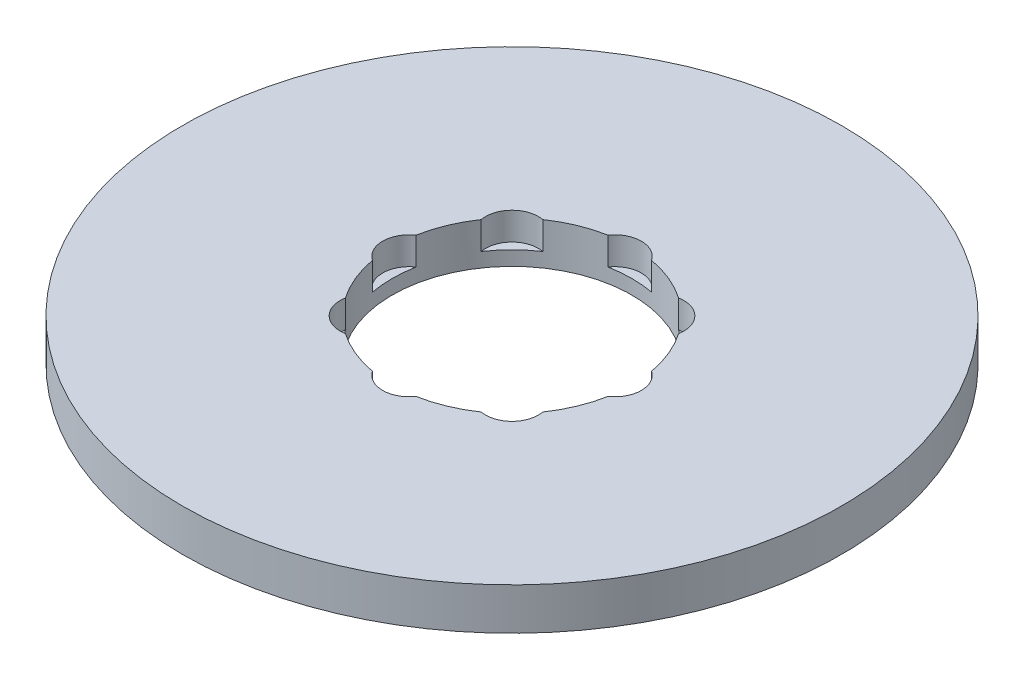
ISO-10303-21;
HEADER;
FILE_DESCRIPTION(('STEP AP214'),'2;1');
FILE_NAME('part.step','',(''),(''),'','','');
FILE_SCHEMA(('AUTOMOTIVE_DESIGN { 1 0 10303 214 1 1 1 1 }'));
ENDSEC;
DATA;
#1=APPLICATION_CONTEXT('core data for automotive mechanical design processes');
#2=APPLICATION_PROTOCOL_DEFINITION('international standard','automotive_design',2000,#1);
#3=PRODUCT_CONTEXT('',#1,'mechanical');
#4=PRODUCT('Part','Part','',(#3));
#5=PRODUCT_RELATED_PRODUCT_CATEGORY('part','',(#4));
#6=PRODUCT_DEFINITION_FORMATION('','',#4);
#7=PRODUCT_DEFINITION_CONTEXT('part definition',#1,'design');
#8=PRODUCT_DEFINITION('design','',#6,#7);
#9=PRODUCT_DEFINITION_SHAPE('','',#8);
#10=(LENGTH_UNIT() NAMED_UNIT(*) SI_UNIT(.MILLI.,.METRE.));
#11=(NAMED_UNIT(*) PLANE_ANGLE_UNIT() SI_UNIT($,.RADIAN.));
#12=(NAMED_UNIT(*) SI_UNIT($,.STERADIAN.) SOLID_ANGLE_UNIT());
#13=UNCERTAINTY_MEASURE_WITH_UNIT(LENGTH_MEASURE(1.E-05),#10,'distance_accuracy_value','');
#14=(GEOMETRIC_REPRESENTATION_CONTEXT(3) GLOBAL_UNCERTAINTY_ASSIGNED_CONTEXT((#13)) GLOBAL_UNIT_ASSIGNED_CONTEXT((#10,
#11,#12)) REPRESENTATION_CONTEXT('',''));
#15=CARTESIAN_POINT('',(0.,0.,0.));
#16=DIRECTION('',(0.,0.,1.));
#17=DIRECTION('',(1.,0.,0.));
#18=AXIS2_PLACEMENT_3D('',#15,#16,#17);
#19=CARTESIAN_POINT('',(0.,7.,0.));
#20=DIRECTION('',(0.,-1.,0.));
#21=DIRECTION('',(0.,0.,-1.));
#22=AXIS2_PLACEMENT_3D('',#19,#20,#21);
#23=CYLINDRICAL_SURFACE('',#22,55.);
#24=CARTESIAN_POINT('',(0.,7.,0.));
#25=DIRECTION('',(0.,1.,0.));
#26=DIRECTION('',(0.,0.,1.));
#27=AXIS2_PLACEMENT_3D('',#24,#25,#26);
#28=CIRCLE('',#27,55.);
#29=CARTESIAN_POINT('',(0.,7.,55.));
#30=VERTEX_POINT('',#29);
#31=EDGE_CURVE('E183',#30,#30,#28,.T.);
#32=ORIENTED_EDGE('',*,*,#31,.F.);
#33=EDGE_LOOP('',(#32));
#34=FACE_BOUND('',#33,.T.);
#35=CARTESIAN_POINT('',(0.,0.,0.));
#36=DIRECTION('',(0.,1.,0.));
#37=DIRECTION('',(0.,0.,1.));
#38=AXIS2_PLACEMENT_3D('',#35,#36,#37);
#39=CIRCLE('',#38,55.);
#40=CARTESIAN_POINT('',(0.,0.,55.));
#41=VERTEX_POINT('',#40);
#42=EDGE_CURVE('E182',#41,#41,#39,.T.);
#43=ORIENTED_EDGE('',*,*,#42,.T.);
#44=EDGE_LOOP('',(#43));
#45=FACE_BOUND('',#44,.T.);
#46=ADVANCED_FACE('F39',(#34,#45),#23,.T.);
#47=CARTESIAN_POINT('',(0.,7.,0.));
#48=DIRECTION('',(0.,1.,0.));
#49=DIRECTION('',(0.,0.,1.));
#50=AXIS2_PLACEMENT_3D('',#47,#48,#49);
#51=PLANE('',#50);
#52=CARTESIAN_POINT('',(0.,7.,17.1753294967243));
#53=DIRECTION('',(0.,1.,0.));
#54=DIRECTION('',(1.,0.,0.));
#55=AXIS2_PLACEMENT_3D('',#52,#53,#54);
#56=CIRCLE('',#55,4.40705011362245);
#57=CARTESIAN_POINT('',(-3.63515199168003,7.,19.6668673152941));
#58=VERTEX_POINT('',#57);
#59=CARTESIAN_POINT('',(3.63515199168017,7.,19.6668673152941));
#60=VERTEX_POINT('',#59);
#61=EDGE_CURVE('E256',#58,#60,#56,.T.);
#62=ORIENTED_EDGE('',*,*,#61,.F.);
#63=CARTESIAN_POINT('',(0.,7.,0.));
#64=DIRECTION('',(0.,1.,0.));
#65=DIRECTION('',(0.,0.,1.));
#66=AXIS2_PLACEMENT_3D('',#63,#64,#65);
#67=CIRCLE('',#66,20.);
#68=CARTESIAN_POINT('',(-11.3361346193797,7.,16.4770158673014));
#69=VERTEX_POINT('',#68);
#70=EDGE_CURVE('E175',#69,#58,#67,.T.);
#71=ORIENTED_EDGE('',*,*,#70,.F.);
#72=CARTESIAN_POINT('',(-12.144791956247,7.,12.1447919562471));
#73=DIRECTION('',(0.,1.,0.));
#74=DIRECTION('',(0.707106781186549,0.,0.707106781186546));
#75=AXIS2_PLACEMENT_3D('',#72,#73,#74);
#76=CIRCLE('',#75,4.40705011362245);
#77=CARTESIAN_POINT('',(-16.4770158673013,7.,11.3361346193798));
#78=VERTEX_POINT('',#77);
#79=EDGE_CURVE('E152',#78,#69,#76,.T.);
#80=ORIENTED_EDGE('',*,*,#79,.F.);
#81=CARTESIAN_POINT('',(-19.6668673152941,7.,3.6351519916801));
#82=VERTEX_POINT('',#81);
#83=EDGE_CURVE('E168',#82,#78,#67,.T.);
#84=ORIENTED_EDGE('',*,*,#83,.F.);
#85=CARTESIAN_POINT('',(-17.1753294967243,7.,0.));
#86=DIRECTION('',(0.,1.,0.));
#87=DIRECTION('',(0.,0.,1.));
#88=AXIS2_PLACEMENT_3D('',#85,#86,#87);
#89=CIRCLE('',#88,4.40705011362245);
#90=CARTESIAN_POINT('',(-19.6668673152941,7.,-3.6351519916801));
#91=VERTEX_POINT('',#90);
#92=EDGE_CURVE('E205',#91,#82,#89,.T.);
#93=ORIENTED_EDGE('',*,*,#92,.F.);
#94=CARTESIAN_POINT('',(-16.4770158673015,7.,-11.3361346193796));
#95=VERTEX_POINT('',#94);
#96=EDGE_CURVE('E181',#95,#91,#67,.T.);
#97=ORIENTED_EDGE('',*,*,#96,.F.);
#98=CARTESIAN_POINT('',(-12.1447919562472,7.,-12.1447919562469));
#99=DIRECTION('',(0.,1.,0.));
#100=DIRECTION('',(-0.707106781186539,0.,0.707106781186556));
#101=AXIS2_PLACEMENT_3D('',#98,#99,#100);
#102=CIRCLE('',#101,4.40705011362245);
#103=CARTESIAN_POINT('',(-11.33613461938,7.,-16.4770158673012));
#104=VERTEX_POINT('',#103);
#105=EDGE_CURVE('E453',#104,#95,#102,.T.);
#106=ORIENTED_EDGE('',*,*,#105,.F.);
#107=CARTESIAN_POINT('',(-3.63515199168031,7.,-19.6668673152941));
#108=VERTEX_POINT('',#107);
#109=EDGE_CURVE('E189',#108,#104,#67,.T.);
#110=ORIENTED_EDGE('',*,*,#109,.F.);
#111=CARTESIAN_POINT('',(-1.79902027278884E-13,7.,-17.1753294967243));
#112=DIRECTION('',(0.,1.,0.));
#113=DIRECTION('',(-1.,0.,0.));
#114=AXIS2_PLACEMENT_3D('',#111,#112,#113);
#115=CIRCLE('',#114,4.40705011362245);
#116=CARTESIAN_POINT('',(3.6351519916799,7.,-19.6668673152942));
#117=VERTEX_POINT('',#116);
#118=EDGE_CURVE('E462',#117,#108,#115,.T.);
#119=ORIENTED_EDGE('',*,*,#118,.F.);
#120=CARTESIAN_POINT('',(11.3361346193796,7.,-16.4770158673014));
#121=VERTEX_POINT('',#120);
#122=EDGE_CURVE('E197',#121,#117,#67,.T.);
#123=ORIENTED_EDGE('',*,*,#122,.F.);
#124=CARTESIAN_POINT('',(12.144791956247,7.,-12.1447919562472));
#125=DIRECTION('',(0.,1.,0.));
#126=DIRECTION('',(-0.707106781186554,0.,-0.707106781186541));
#127=AXIS2_PLACEMENT_3D('',#124,#125,#126);
#128=CIRCLE('',#127,4.40705011362245);
#129=CARTESIAN_POINT('',(16.4770158673012,7.,-11.3361346193799));
#130=VERTEX_POINT('',#129);
#131=EDGE_CURVE('E470',#130,#121,#128,.T.);
#132=ORIENTED_EDGE('',*,*,#131,.F.);
#133=CARTESIAN_POINT('',(19.6668673152941,7.,-3.6351519916801));
#134=VERTEX_POINT('',#133);
#135=EDGE_CURVE('E489',#134,#130,#67,.T.);
#136=ORIENTED_EDGE('',*,*,#135,.F.);
#137=CARTESIAN_POINT('',(17.1753294967243,7.,0.));
#138=DIRECTION('',(0.,1.,0.));
#139=DIRECTION('',(0.,0.,-1.));
#140=AXIS2_PLACEMENT_3D('',#137,#138,#139);
#141=CIRCLE('',#140,4.40705011362245);
#142=CARTESIAN_POINT('',(19.6668673152941,7.,3.6351519916801));
#143=VERTEX_POINT('',#142);
#144=EDGE_CURVE('E476',#143,#134,#141,.T.);
#145=ORIENTED_EDGE('',*,*,#144,.F.);
#146=CARTESIAN_POINT('',(16.4770158673014,7.,11.3361346193797));
#147=VERTEX_POINT('',#146);
#148=EDGE_CURVE('E491',#147,#143,#67,.T.);
#149=ORIENTED_EDGE('',*,*,#148,.F.);
#150=CARTESIAN_POINT('',(12.1447919562471,7.,12.144791956247));
#151=DIRECTION('',(0.,1.,0.));
#152=DIRECTION('',(0.707106781186544,0.,-0.707106781186551));
#153=AXIS2_PLACEMENT_3D('',#150,#151,#152);
#154=CIRCLE('',#153,4.40705011362245);
#155=CARTESIAN_POINT('',(11.3361346193798,7.,16.4770158673013));
#156=VERTEX_POINT('',#155);
#157=EDGE_CURVE('E475',#156,#147,#154,.T.);
#158=ORIENTED_EDGE('',*,*,#157,.F.);
#159=EDGE_CURVE('E190',#60,#156,#67,.T.);
#160=ORIENTED_EDGE('',*,*,#159,.F.);
#161=EDGE_LOOP('',(#62,#71,#80,#84,#93,#97,#106,#110,#119,#123,#132,#136,#145,#149,#158,#160));
#162=FACE_BOUND('',#161,.T.);
#163=ORIENTED_EDGE('',*,*,#31,.T.);
#164=EDGE_LOOP('',(#163));
#165=FACE_BOUND('',#164,.T.);
#166=ADVANCED_FACE('F170',(#162,#165),#51,.T.);
#167=CARTESIAN_POINT('',(0.,0.,0.));
#168=DIRECTION('',(0.,1.,0.));
#169=DIRECTION('',(0.,0.,1.));
#170=AXIS2_PLACEMENT_3D('',#167,#168,#169);
#171=PLANE('',#170);
#172=CARTESIAN_POINT('',(0.,0.,0.));
#173=DIRECTION('',(0.,1.,0.));
#174=DIRECTION('',(0.,0.,1.));
#175=AXIS2_PLACEMENT_3D('',#172,#173,#174);
#176=CIRCLE('',#175,20.);
#177=CARTESIAN_POINT('',(0.,0.,20.));
#178=VERTEX_POINT('',#177);
#179=EDGE_CURVE('E191',#178,#178,#176,.T.);
#180=ORIENTED_EDGE('',*,*,#179,.T.);
#181=EDGE_LOOP('',(#180));
#182=FACE_BOUND('',#181,.T.);
#183=ORIENTED_EDGE('',*,*,#42,.F.);
#184=EDGE_LOOP('',(#183));
#185=FACE_BOUND('',#184,.T.);
#186=ADVANCED_FACE('F277',(#182,#185),#171,.F.);
#187=CARTESIAN_POINT('',(0.,7.,0.));
#188=DIRECTION('',(0.,-1.,0.));
#189=DIRECTION('',(0.,0.,-1.));
#190=AXIS2_PLACEMENT_3D('',#187,#188,#189);
#191=CYLINDRICAL_SURFACE('',#190,20.);
#192=DIRECTION('',(0.,1.,0.));
#193=VECTOR('',#192,1.);
#194=CARTESIAN_POINT('',(-3.63515199168003,4.69661901688909,19.6668673152941));
#195=LINE('',#194,#193);
#196=CARTESIAN_POINT('',(-3.63515199168003,2.39323803377817,19.6668673152941));
#197=VERTEX_POINT('',#196);
#198=EDGE_CURVE('E11',#197,#58,#195,.T.);
#199=ORIENTED_EDGE('',*,*,#198,.F.);
#200=CARTESIAN_POINT('',(0.,2.39323803377817,0.));
#201=DIRECTION('',(0.,1.,0.));
#202=DIRECTION('',(0.,0.,1.));
#203=AXIS2_PLACEMENT_3D('',#200,#201,#202);
#204=CIRCLE('',#203,20.);
#205=CARTESIAN_POINT('',(3.63515199168017,2.39323803377817,19.6668673152941));
#206=VERTEX_POINT('',#205);
#207=EDGE_CURVE('E251',#197,#206,#204,.T.);
#208=ORIENTED_EDGE('',*,*,#207,.T.);
#209=DIRECTION('',(0.,1.,0.));
#210=VECTOR('',#209,1.);
#211=CARTESIAN_POINT('',(3.63515199168017,4.69661901688909,19.6668673152941));
#212=LINE('',#211,#210);
#213=EDGE_CURVE('E46',#60,#206,#212,.F.);
#214=ORIENTED_EDGE('',*,*,#213,.F.);
#215=ORIENTED_EDGE('',*,*,#159,.T.);
#216=DIRECTION('',(0.,1.,0.));
#217=VECTOR('',#216,1.);
#218=CARTESIAN_POINT('',(11.3361346193799,4.69661901688909,16.4770158673013));
#219=LINE('',#218,#217);
#220=CARTESIAN_POINT('',(11.3361346193798,2.39323803377817,16.4770158673013));
#221=VERTEX_POINT('',#220);
#222=EDGE_CURVE('E253',#221,#156,#219,.T.);
#223=ORIENTED_EDGE('',*,*,#222,.F.);
#224=CARTESIAN_POINT('',(0.,2.39323803377817,0.));
#225=DIRECTION('',(0.,1.,0.));
#226=DIRECTION('',(0.,0.,1.));
#227=AXIS2_PLACEMENT_3D('',#224,#225,#226);
#228=CIRCLE('',#227,20.);
#229=CARTESIAN_POINT('',(16.4770158673014,2.39323803377817,11.3361346193797));
#230=VERTEX_POINT('',#229);
#231=EDGE_CURVE('E246',#221,#230,#228,.T.);
#232=ORIENTED_EDGE('',*,*,#231,.T.);
#233=DIRECTION('',(0.,1.,0.));
#234=VECTOR('',#233,1.);
#235=CARTESIAN_POINT('',(16.4770158673014,4.69661901688909,11.3361346193797));
#236=LINE('',#235,#234);
#237=EDGE_CURVE('E248',#147,#230,#236,.F.);
#238=ORIENTED_EDGE('',*,*,#237,.F.);
#239=ORIENTED_EDGE('',*,*,#148,.T.);
#240=DIRECTION('',(0.,1.,0.));
#241=VECTOR('',#240,1.);
#242=CARTESIAN_POINT('',(19.6668673152941,4.69661901688909,3.6351519916801));
#243=LINE('',#242,#241);
#244=CARTESIAN_POINT('',(19.6668673152941,2.39323803377817,3.6351519916801));
#245=VERTEX_POINT('',#244);
#246=EDGE_CURVE('E243',#245,#143,#243,.T.);
#247=ORIENTED_EDGE('',*,*,#246,.F.);
#248=CARTESIAN_POINT('',(0.,2.39323803377817,0.));
#249=DIRECTION('',(0.,1.,0.));
#250=DIRECTION('',(0.,0.,1.));
#251=AXIS2_PLACEMENT_3D('',#248,#249,#250);
#252=CIRCLE('',#251,20.);
#253=CARTESIAN_POINT('',(19.6668673152941,2.39323803377817,-3.6351519916801));
#254=VERTEX_POINT('',#253);
#255=EDGE_CURVE('E236',#245,#254,#252,.T.);
#256=ORIENTED_EDGE('',*,*,#255,.T.);
#257=DIRECTION('',(0.,1.,0.));
#258=VECTOR('',#257,1.);
#259=CARTESIAN_POINT('',(19.6668673152941,4.69661901688909,-3.6351519916801));
#260=LINE('',#259,#258);
#261=EDGE_CURVE('E241',#134,#254,#260,.F.);
#262=ORIENTED_EDGE('',*,*,#261,.F.);
#263=ORIENTED_EDGE('',*,*,#135,.T.);
#264=DIRECTION('',(0.,1.,0.));
#265=VECTOR('',#264,1.);
#266=CARTESIAN_POINT('',(16.4770158673012,4.69661901688909,-11.3361346193799));
#267=LINE('',#266,#265);
#268=CARTESIAN_POINT('',(16.4770158673012,2.39323803377817,-11.3361346193799));
#269=VERTEX_POINT('',#268);
#270=EDGE_CURVE('E237',#269,#130,#267,.T.);
#271=ORIENTED_EDGE('',*,*,#270,.F.);
#272=CARTESIAN_POINT('',(0.,2.39323803377817,0.));
#273=DIRECTION('',(0.,1.,0.));
#274=DIRECTION('',(0.,0.,1.));
#275=AXIS2_PLACEMENT_3D('',#272,#273,#274);
#276=CIRCLE('',#275,20.);
#277=CARTESIAN_POINT('',(11.3361346193796,2.39323803377817,-16.4770158673014));
#278=VERTEX_POINT('',#277);
#279=EDGE_CURVE('E229',#269,#278,#276,.T.);
#280=ORIENTED_EDGE('',*,*,#279,.T.);
#281=DIRECTION('',(0.,1.,0.));
#282=VECTOR('',#281,1.);
#283=CARTESIAN_POINT('',(11.3361346193796,4.69661901688909,-16.4770158673014));
#284=LINE('',#283,#282);
#285=EDGE_CURVE('E232',#121,#278,#284,.F.);
#286=ORIENTED_EDGE('',*,*,#285,.F.);
#287=ORIENTED_EDGE('',*,*,#122,.T.);
#288=DIRECTION('',(0.,1.,0.));
#289=VECTOR('',#288,1.);
#290=CARTESIAN_POINT('',(3.6351519916799,4.69661901688909,-19.6668673152942));
#291=LINE('',#290,#289);
#292=CARTESIAN_POINT('',(3.6351519916799,2.39323803377817,-19.6668673152942));
#293=VERTEX_POINT('',#292);
#294=EDGE_CURVE('E227',#293,#117,#291,.T.);
#295=ORIENTED_EDGE('',*,*,#294,.F.);
#296=CARTESIAN_POINT('',(0.,2.39323803377817,0.));
#297=DIRECTION('',(0.,1.,0.));
#298=DIRECTION('',(0.,0.,1.));
#299=AXIS2_PLACEMENT_3D('',#296,#297,#298);
#300=CIRCLE('',#299,20.);
#301=CARTESIAN_POINT('',(-3.63515199168031,2.39323803377817,-19.6668673152941));
#302=VERTEX_POINT('',#301);
#303=EDGE_CURVE('E225',#293,#302,#300,.T.);
#304=ORIENTED_EDGE('',*,*,#303,.T.);
#305=DIRECTION('',(0.,1.,0.));
#306=VECTOR('',#305,1.);
#307=CARTESIAN_POINT('',(-3.63515199168031,4.69661901688909,-19.6668673152941));
#308=LINE('',#307,#306);
#309=EDGE_CURVE('E223',#108,#302,#308,.F.);
#310=ORIENTED_EDGE('',*,*,#309,.F.);
#311=ORIENTED_EDGE('',*,*,#109,.T.);
#312=DIRECTION('',(0.,1.,0.));
#313=VECTOR('',#312,1.);
#314=CARTESIAN_POINT('',(-11.33613461938,4.69661901688909,-16.4770158673012));
#315=LINE('',#314,#313);
#316=CARTESIAN_POINT('',(-11.33613461938,2.39323803377817,-16.4770158673012));
#317=VERTEX_POINT('',#316);
#318=EDGE_CURVE('E219',#317,#104,#315,.T.);
#319=ORIENTED_EDGE('',*,*,#318,.F.);
#320=CARTESIAN_POINT('',(0.,2.39323803377817,0.));
#321=DIRECTION('',(0.,1.,0.));
#322=DIRECTION('',(0.,0.,1.));
#323=AXIS2_PLACEMENT_3D('',#320,#321,#322);
#324=CIRCLE('',#323,20.);
#325=CARTESIAN_POINT('',(-16.4770158673015,2.39323803377817,-11.3361346193796));
#326=VERTEX_POINT('',#325);
#327=EDGE_CURVE('E159',#317,#326,#324,.T.);
#328=ORIENTED_EDGE('',*,*,#327,.T.);
#329=DIRECTION('',(0.,1.,0.));
#330=VECTOR('',#329,1.);
#331=CARTESIAN_POINT('',(-16.4770158673015,4.69661901688909,-11.3361346193796));
#332=LINE('',#331,#330);
#333=EDGE_CURVE('E220',#95,#326,#332,.F.);
#334=ORIENTED_EDGE('',*,*,#333,.F.);
#335=ORIENTED_EDGE('',*,*,#96,.T.);
#336=DIRECTION('',(0.,1.,0.));
#337=VECTOR('',#336,1.);
#338=CARTESIAN_POINT('',(-19.6668673152941,4.69661901688909,-3.6351519916801));
#339=LINE('',#338,#337);
#340=CARTESIAN_POINT('',(-19.6668673152941,2.39323803377817,-3.6351519916801));
#341=VERTEX_POINT('',#340);
#342=EDGE_CURVE('E209',#341,#91,#339,.T.);
#343=ORIENTED_EDGE('',*,*,#342,.F.);
#344=CARTESIAN_POINT('',(0.,2.39323803377817,0.));
#345=DIRECTION('',(0.,1.,0.));
#346=DIRECTION('',(0.,0.,1.));
#347=AXIS2_PLACEMENT_3D('',#344,#345,#346);
#348=CIRCLE('',#347,20.);
#349=CARTESIAN_POINT('',(-19.6668673152941,2.39323803377817,3.6351519916801));
#350=VERTEX_POINT('',#349);
#351=EDGE_CURVE('E206',#341,#350,#348,.T.);
#352=ORIENTED_EDGE('',*,*,#351,.T.);
#353=DIRECTION('',(0.,1.,0.));
#354=VECTOR('',#353,1.);
#355=CARTESIAN_POINT('',(-19.6668673152941,4.69661901688909,3.6351519916801));
#356=LINE('',#355,#354);
#357=EDGE_CURVE('E179',#82,#350,#356,.F.);
#358=ORIENTED_EDGE('',*,*,#357,.F.);
#359=ORIENTED_EDGE('',*,*,#83,.T.);
#360=DIRECTION('',(0.,1.,0.));
#361=VECTOR('',#360,1.);
#362=CARTESIAN_POINT('',(-16.4770158673013,4.69661901688909,11.3361346193798));
#363=LINE('',#362,#361);
#364=CARTESIAN_POINT('',(-16.4770158673013,2.39323803377817,11.3361346193798));
#365=VERTEX_POINT('',#364);
#366=EDGE_CURVE('E147',#365,#78,#363,.T.);
#367=ORIENTED_EDGE('',*,*,#366,.F.);
#368=CARTESIAN_POINT('',(0.,2.39323803377817,0.));
#369=DIRECTION('',(0.,1.,0.));
#370=DIRECTION('',(0.,0.,1.));
#371=AXIS2_PLACEMENT_3D('',#368,#369,#370);
#372=CIRCLE('',#371,20.);
#373=CARTESIAN_POINT('',(-11.3361346193797,2.39323803377817,16.4770158673014));
#374=VERTEX_POINT('',#373);
#375=EDGE_CURVE('E215',#365,#374,#372,.T.);
#376=ORIENTED_EDGE('',*,*,#375,.T.);
#377=DIRECTION('',(0.,1.,0.));
#378=VECTOR('',#377,1.);
#379=CARTESIAN_POINT('',(-11.3361346193797,4.69661901688909,16.4770158673014));
#380=LINE('',#379,#378);
#381=EDGE_CURVE('E161',#69,#374,#380,.F.);
#382=ORIENTED_EDGE('',*,*,#381,.F.);
#383=ORIENTED_EDGE('',*,*,#70,.T.);
#384=EDGE_LOOP('',(#199,#208,#214,#215,#223,#232,#238,#239,#247,#256,#262,#263,#271,#280,#286,
#287,#295,#304,#310,#311,#319,#328,#334,#335,#343,#352,#358,#359,#367,#376,#382,#383));
#385=FACE_BOUND('',#384,.T.);
#386=ORIENTED_EDGE('',*,*,#179,.F.);
#387=EDGE_LOOP('',(#386));
#388=FACE_BOUND('',#387,.T.);
#389=ADVANCED_FACE('F176',(#385,#388),#191,.F.);
#390=CARTESIAN_POINT('',(-17.1753294967243,2.39323803377817,0.));
#391=DIRECTION('',(0.,1.,0.));
#392=DIRECTION('',(0.,0.,1.));
#393=AXIS2_PLACEMENT_3D('',#390,#391,#392);
#394=CYLINDRICAL_SURFACE('',#393,4.40705011362245);
#395=ORIENTED_EDGE('',*,*,#342,.T.);
#396=ORIENTED_EDGE('',*,*,#92,.T.);
#397=ORIENTED_EDGE('',*,*,#357,.T.);
#398=CARTESIAN_POINT('',(-17.1753294967243,2.39323803377817,0.));
#399=DIRECTION('',(0.,1.,0.));
#400=DIRECTION('',(0.,0.,1.));
#401=AXIS2_PLACEMENT_3D('',#398,#399,#400);
#402=CIRCLE('',#401,4.40705011362245);
#403=EDGE_CURVE('E200',#341,#350,#402,.T.);
#404=ORIENTED_EDGE('',*,*,#403,.F.);
#405=EDGE_LOOP('',(#395,#396,#397,#404));
#406=FACE_BOUND('',#405,.T.);
#407=ADVANCED_FACE('F286',(#406),#394,.F.);
#408=CARTESIAN_POINT('',(-17.1753294967243,2.39323803377817,0.));
#409=DIRECTION('',(0.,1.,0.));
#410=DIRECTION('',(0.,0.,1.));
#411=AXIS2_PLACEMENT_3D('',#408,#409,#410);
#412=PLANE('',#411);
#413=ORIENTED_EDGE('',*,*,#403,.T.);
#414=ORIENTED_EDGE('',*,*,#351,.F.);
#415=EDGE_LOOP('',(#413,#414));
#416=FACE_BOUND('',#415,.T.);
#417=ADVANCED_FACE('F289',(#416),#412,.T.);
#418=CARTESIAN_POINT('',(-12.144791956247,2.39323803377817,12.1447919562471));
#419=DIRECTION('',(0.,1.,0.));
#420=DIRECTION('',(0.,0.,1.));
#421=AXIS2_PLACEMENT_3D('',#418,#419,#420);
#422=CYLINDRICAL_SURFACE('',#421,4.40705011362245);
#423=ORIENTED_EDGE('',*,*,#366,.T.);
#424=ORIENTED_EDGE('',*,*,#79,.T.);
#425=ORIENTED_EDGE('',*,*,#381,.T.);
#426=CARTESIAN_POINT('',(-12.144791956247,2.39323803377817,12.1447919562471));
#427=DIRECTION('',(0.,1.,0.));
#428=DIRECTION('',(0.707106781186549,0.,0.707106781186546));
#429=AXIS2_PLACEMENT_3D('',#426,#427,#428);
#430=CIRCLE('',#429,4.40705011362245);
#431=EDGE_CURVE('E156',#365,#374,#430,.T.);
#432=ORIENTED_EDGE('',*,*,#431,.F.);
#433=EDGE_LOOP('',(#423,#424,#425,#432));
#434=FACE_BOUND('',#433,.T.);
#435=ADVANCED_FACE('F155',(#434),#422,.F.);
#436=CARTESIAN_POINT('',(-12.144791956247,2.39323803377817,12.1447919562471));
#437=DIRECTION('',(0.,1.,0.));
#438=DIRECTION('',(0.707106781186549,0.,0.707106781186546));
#439=AXIS2_PLACEMENT_3D('',#436,#437,#438);
#440=PLANE('',#439);
#441=ORIENTED_EDGE('',*,*,#431,.T.);
#442=ORIENTED_EDGE('',*,*,#375,.F.);
#443=EDGE_LOOP('',(#441,#442));
#444=FACE_BOUND('',#443,.T.);
#445=ADVANCED_FACE('F300',(#444),#440,.T.);
#446=CARTESIAN_POINT('',(-12.1447919562472,2.39323803377817,-12.1447919562469));
#447=DIRECTION('',(0.,1.,0.));
#448=DIRECTION('',(0.,0.,1.));
#449=AXIS2_PLACEMENT_3D('',#446,#447,#448);
#450=CYLINDRICAL_SURFACE('',#449,4.40705011362245);
#451=ORIENTED_EDGE('',*,*,#318,.T.);
#452=ORIENTED_EDGE('',*,*,#105,.T.);
#453=ORIENTED_EDGE('',*,*,#333,.T.);
#454=CARTESIAN_POINT('',(-12.1447919562472,2.39323803377817,-12.1447919562469));
#455=DIRECTION('',(0.,1.,0.));
#456=DIRECTION('',(-0.707106781186539,0.,0.707106781186556));
#457=AXIS2_PLACEMENT_3D('',#454,#455,#456);
#458=CIRCLE('',#457,4.40705011362245);
#459=EDGE_CURVE('E454',#317,#326,#458,.T.);
#460=ORIENTED_EDGE('',*,*,#459,.F.);
#461=EDGE_LOOP('',(#451,#452,#453,#460));
#462=FACE_BOUND('',#461,.T.);
#463=ADVANCED_FACE('F299',(#462),#450,.F.);
#464=CARTESIAN_POINT('',(-12.1447919562472,2.39323803377817,-12.1447919562469));
#465=DIRECTION('',(0.,1.,0.));
#466=DIRECTION('',(-0.707106781186539,0.,0.707106781186556));
#467=AXIS2_PLACEMENT_3D('',#464,#465,#466);
#468=PLANE('',#467);
#469=ORIENTED_EDGE('',*,*,#459,.T.);
#470=ORIENTED_EDGE('',*,*,#327,.F.);
#471=EDGE_LOOP('',(#469,#470));
#472=FACE_BOUND('',#471,.T.);
#473=ADVANCED_FACE('F379',(#472),#468,.T.);
#474=CARTESIAN_POINT('',(-1.79902027278884E-13,2.39323803377817,-17.1753294967243));
#475=DIRECTION('',(0.,1.,0.));
#476=DIRECTION('',(0.,0.,1.));
#477=AXIS2_PLACEMENT_3D('',#474,#475,#476);
#478=CYLINDRICAL_SURFACE('',#477,4.40705011362245);
#479=ORIENTED_EDGE('',*,*,#294,.T.);
#480=ORIENTED_EDGE('',*,*,#118,.T.);
#481=ORIENTED_EDGE('',*,*,#309,.T.);
#482=CARTESIAN_POINT('',(-1.79902027278884E-13,2.39323803377817,-17.1753294967243));
#483=DIRECTION('',(0.,1.,0.));
#484=DIRECTION('',(-1.,0.,0.));
#485=AXIS2_PLACEMENT_3D('',#482,#483,#484);
#486=CIRCLE('',#485,4.40705011362245);
#487=EDGE_CURVE('E465',#293,#302,#486,.T.);
#488=ORIENTED_EDGE('',*,*,#487,.F.);
#489=EDGE_LOOP('',(#479,#480,#481,#488));
#490=FACE_BOUND('',#489,.T.);
#491=ADVANCED_FACE('F371',(#490),#478,.F.);
#492=CARTESIAN_POINT('',(-1.79902027278884E-13,2.39323803377817,-17.1753294967243));
#493=DIRECTION('',(0.,1.,0.));
#494=DIRECTION('',(-1.,0.,0.));
#495=AXIS2_PLACEMENT_3D('',#492,#493,#494);
#496=PLANE('',#495);
#497=ORIENTED_EDGE('',*,*,#487,.T.);
#498=ORIENTED_EDGE('',*,*,#303,.F.);
#499=EDGE_LOOP('',(#497,#498));
#500=FACE_BOUND('',#499,.T.);
#501=ADVANCED_FACE('F308',(#500),#496,.T.);
#502=CARTESIAN_POINT('',(12.144791956247,2.39323803377817,-12.1447919562472));
#503=DIRECTION('',(0.,1.,0.));
#504=DIRECTION('',(0.,0.,1.));
#505=AXIS2_PLACEMENT_3D('',#502,#503,#504);
#506=CYLINDRICAL_SURFACE('',#505,4.40705011362245);
#507=ORIENTED_EDGE('',*,*,#270,.T.);
#508=ORIENTED_EDGE('',*,*,#131,.T.);
#509=ORIENTED_EDGE('',*,*,#285,.T.);
#510=CARTESIAN_POINT('',(12.144791956247,2.39323803377817,-12.1447919562472));
#511=DIRECTION('',(0.,1.,0.));
#512=DIRECTION('',(-0.707106781186554,0.,-0.707106781186541));
#513=AXIS2_PLACEMENT_3D('',#510,#511,#512);
#514=CIRCLE('',#513,4.40705011362245);
#515=EDGE_CURVE('E477',#269,#278,#514,.T.);
#516=ORIENTED_EDGE('',*,*,#515,.F.);
#517=EDGE_LOOP('',(#507,#508,#509,#516));
#518=FACE_BOUND('',#517,.T.);
#519=ADVANCED_FACE('F305',(#518),#506,.F.);
#520=CARTESIAN_POINT('',(12.144791956247,2.39323803377817,-12.1447919562472));
#521=DIRECTION('',(0.,1.,0.));
#522=DIRECTION('',(-0.707106781186554,0.,-0.707106781186541));
#523=AXIS2_PLACEMENT_3D('',#520,#521,#522);
#524=PLANE('',#523);
#525=ORIENTED_EDGE('',*,*,#515,.T.);
#526=ORIENTED_EDGE('',*,*,#279,.F.);
#527=EDGE_LOOP('',(#525,#526));
#528=FACE_BOUND('',#527,.T.);
#529=ADVANCED_FACE('F304',(#528),#524,.T.);
#530=CARTESIAN_POINT('',(17.1753294967243,2.39323803377817,0.));
#531=DIRECTION('',(0.,1.,0.));
#532=DIRECTION('',(0.,0.,1.));
#533=AXIS2_PLACEMENT_3D('',#530,#531,#532);
#534=CYLINDRICAL_SURFACE('',#533,4.40705011362245);
#535=ORIENTED_EDGE('',*,*,#246,.T.);
#536=ORIENTED_EDGE('',*,*,#144,.T.);
#537=ORIENTED_EDGE('',*,*,#261,.T.);
#538=CARTESIAN_POINT('',(17.1753294967243,2.39323803377817,0.));
#539=DIRECTION('',(0.,1.,0.));
#540=DIRECTION('',(0.,0.,-1.));
#541=AXIS2_PLACEMENT_3D('',#538,#539,#540);
#542=CIRCLE('',#541,4.40705011362245);
#543=EDGE_CURVE('E478',#245,#254,#542,.T.);
#544=ORIENTED_EDGE('',*,*,#543,.F.);
#545=EDGE_LOOP('',(#535,#536,#537,#544));
#546=FACE_BOUND('',#545,.T.);
#547=ADVANCED_FACE('F309',(#546),#534,.F.);
#548=CARTESIAN_POINT('',(17.1753294967243,2.39323803377817,0.));
#549=DIRECTION('',(0.,1.,0.));
#550=DIRECTION('',(0.,0.,-1.));
#551=AXIS2_PLACEMENT_3D('',#548,#549,#550);
#552=PLANE('',#551);
#553=ORIENTED_EDGE('',*,*,#543,.T.);
#554=ORIENTED_EDGE('',*,*,#255,.F.);
#555=EDGE_LOOP('',(#553,#554));
#556=FACE_BOUND('',#555,.T.);
#557=ADVANCED_FACE('F314',(#556),#552,.T.);
#558=CARTESIAN_POINT('',(12.1447919562471,2.39323803377817,12.144791956247));
#559=DIRECTION('',(0.,1.,0.));
#560=DIRECTION('',(0.,0.,1.));
#561=AXIS2_PLACEMENT_3D('',#558,#559,#560);
#562=CYLINDRICAL_SURFACE('',#561,4.40705011362245);
#563=ORIENTED_EDGE('',*,*,#222,.T.);
#564=ORIENTED_EDGE('',*,*,#157,.T.);
#565=ORIENTED_EDGE('',*,*,#237,.T.);
#566=CARTESIAN_POINT('',(12.1447919562471,2.39323803377817,12.144791956247));
#567=DIRECTION('',(0.,1.,0.));
#568=DIRECTION('',(0.707106781186544,0.,-0.707106781186551));
#569=AXIS2_PLACEMENT_3D('',#566,#567,#568);
#570=CIRCLE('',#569,4.40705011362245);
#571=EDGE_CURVE('E56',#221,#230,#570,.T.);
#572=ORIENTED_EDGE('',*,*,#571,.F.);
#573=EDGE_LOOP('',(#563,#564,#565,#572));
#574=FACE_BOUND('',#573,.T.);
#575=ADVANCED_FACE('F318',(#574),#562,.F.);
#576=CARTESIAN_POINT('',(12.1447919562471,2.39323803377817,12.144791956247));
#577=DIRECTION('',(0.,1.,0.));
#578=DIRECTION('',(0.707106781186544,0.,-0.707106781186551));
#579=AXIS2_PLACEMENT_3D('',#576,#577,#578);
#580=PLANE('',#579);
#581=ORIENTED_EDGE('',*,*,#571,.T.);
#582=ORIENTED_EDGE('',*,*,#231,.F.);
#583=EDGE_LOOP('',(#581,#582));
#584=FACE_BOUND('',#583,.T.);
#585=ADVANCED_FACE('F270',(#584),#580,.T.);
#586=CARTESIAN_POINT('',(0.,2.39323803377817,17.1753294967243));
#587=DIRECTION('',(0.,1.,0.));
#588=DIRECTION('',(0.,0.,1.));
#589=AXIS2_PLACEMENT_3D('',#586,#587,#588);
#590=CYLINDRICAL_SURFACE('',#589,4.40705011362245);
#591=ORIENTED_EDGE('',*,*,#198,.T.);
#592=ORIENTED_EDGE('',*,*,#61,.T.);
#593=ORIENTED_EDGE('',*,*,#213,.T.);
#594=CARTESIAN_POINT('',(0.,2.39323803377817,17.1753294967243));
#595=DIRECTION('',(0.,1.,0.));
#596=DIRECTION('',(1.,0.,0.));
#597=AXIS2_PLACEMENT_3D('',#594,#595,#596);
#598=CIRCLE('',#597,4.40705011362245);
#599=EDGE_CURVE('E55',#197,#206,#598,.T.);
#600=ORIENTED_EDGE('',*,*,#599,.F.);
#601=EDGE_LOOP('',(#591,#592,#593,#600));
#602=FACE_BOUND('',#601,.T.);
#603=ADVANCED_FACE('F260',(#602),#590,.F.);
#604=CARTESIAN_POINT('',(0.,2.39323803377817,17.1753294967243));
#605=DIRECTION('',(0.,1.,0.));
#606=DIRECTION('',(1.,0.,0.));
#607=AXIS2_PLACEMENT_3D('',#604,#605,#606);
#608=PLANE('',#607);
#609=ORIENTED_EDGE('',*,*,#599,.T.);
#610=ORIENTED_EDGE('',*,*,#207,.F.);
#611=EDGE_LOOP('',(#609,#610));
#612=FACE_BOUND('',#611,.T.);
#613=ADVANCED_FACE('F261',(#612),#608,.T.);
#614=CLOSED_SHELL('',(#46,#166,#186,#389,#407,#417,#435,#445,#463,#473,#491,#501,#519,#529,#547,
#557,#575,#585,#603,#613));
#615=MANIFOLD_SOLID_BREP('B2',#614);
#616=ADVANCED_BREP_SHAPE_REPRESENTATION('',(#18,#615),#14);
#617=SHAPE_DEFINITION_REPRESENTATION(#9,#616);
ENDSEC;
END-ISO-10303-21;
